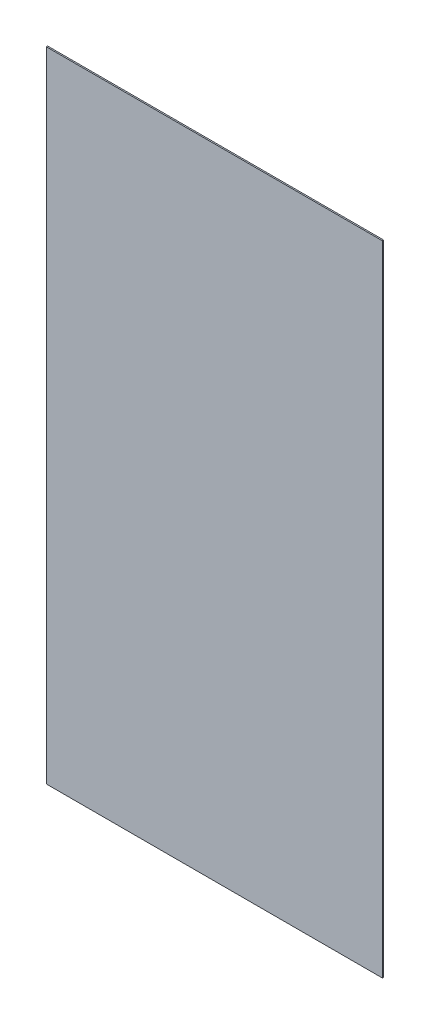
ISO-10303-21;
HEADER;
FILE_DESCRIPTION(('STEP AP214'),'2;1');
FILE_NAME('part.step','',(''),(''),'','','');
FILE_SCHEMA(('AUTOMOTIVE_DESIGN { 1 0 10303 214 1 1 1 1 }'));
ENDSEC;
DATA;
#1=APPLICATION_CONTEXT('core data for automotive mechanical design processes');
#2=APPLICATION_PROTOCOL_DEFINITION('international standard','automotive_design',2000,#1);
#3=PRODUCT_CONTEXT('',#1,'mechanical');
#4=PRODUCT('Part','Part','',(#3));
#5=PRODUCT_RELATED_PRODUCT_CATEGORY('part','',(#4));
#6=PRODUCT_DEFINITION_FORMATION('','',#4);
#7=PRODUCT_DEFINITION_CONTEXT('part definition',#1,'design');
#8=PRODUCT_DEFINITION('design','',#6,#7);
#9=PRODUCT_DEFINITION_SHAPE('','',#8);
#10=(LENGTH_UNIT() NAMED_UNIT(*) SI_UNIT(.MILLI.,.METRE.));
#11=(NAMED_UNIT(*) PLANE_ANGLE_UNIT() SI_UNIT($,.RADIAN.));
#12=(NAMED_UNIT(*) SI_UNIT($,.STERADIAN.) SOLID_ANGLE_UNIT());
#13=UNCERTAINTY_MEASURE_WITH_UNIT(LENGTH_MEASURE(1.E-05),#10,'distance_accuracy_value','');
#14=(GEOMETRIC_REPRESENTATION_CONTEXT(3) GLOBAL_UNCERTAINTY_ASSIGNED_CONTEXT((#13)) GLOBAL_UNIT_ASSIGNED_CONTEXT((#10,
#11,#12)) REPRESENTATION_CONTEXT('',''));
#15=CARTESIAN_POINT('',(0.,0.,0.));
#16=DIRECTION('',(0.,0.,1.));
#17=DIRECTION('',(1.,0.,0.));
#18=AXIS2_PLACEMENT_3D('',#15,#16,#17);
#19=CARTESIAN_POINT('',(0.,0.,0.));
#20=DIRECTION('',(0.,0.,1.));
#21=DIRECTION('',(1.,0.,0.));
#22=AXIS2_PLACEMENT_3D('',#19,#20,#21);
#23=PLANE('',#22);
#24=DIRECTION('',(1.,0.,0.));
#25=VECTOR('',#24,1.);
#26=CARTESIAN_POINT('',(12.7,24.13,0.));
#27=LINE('',#26,#25);
#28=CARTESIAN_POINT('',(12.7,24.13,0.));
#29=VERTEX_POINT('',#28);
#30=CARTESIAN_POINT('',(-12.7,24.13,0.));
#31=VERTEX_POINT('',#30);
#32=EDGE_CURVE('E77',#29,#31,#27,.F.);
#33=ORIENTED_EDGE('',*,*,#32,.F.);
#34=DIRECTION('',(0.,1.,0.));
#35=VECTOR('',#34,1.);
#36=CARTESIAN_POINT('',(12.7,-24.13,0.));
#37=LINE('',#36,#35);
#38=CARTESIAN_POINT('',(12.7,-24.13,0.));
#39=VERTEX_POINT('',#38);
#40=EDGE_CURVE('E53',#39,#29,#37,.T.);
#41=ORIENTED_EDGE('',*,*,#40,.F.);
#42=DIRECTION('',(1.,0.,0.));
#43=VECTOR('',#42,1.);
#44=CARTESIAN_POINT('',(-12.7,-24.13,0.));
#45=LINE('',#44,#43);
#46=CARTESIAN_POINT('',(-12.7,-24.13,0.));
#47=VERTEX_POINT('',#46);
#48=EDGE_CURVE('E55',#47,#39,#45,.T.);
#49=ORIENTED_EDGE('',*,*,#48,.F.);
#50=DIRECTION('',(0.,1.,0.));
#51=VECTOR('',#50,1.);
#52=CARTESIAN_POINT('',(-12.7,24.13,0.));
#53=LINE('',#52,#51);
#54=EDGE_CURVE('E18',#31,#47,#53,.F.);
#55=ORIENTED_EDGE('',*,*,#54,.F.);
#56=EDGE_LOOP('',(#33,#41,#49,#55));
#57=FACE_BOUND('',#56,.T.);
#58=ADVANCED_FACE('F15',(#57),#23,.F.);
#59=CARTESIAN_POINT('',(-12.7,24.13,0.));
#60=DIRECTION('',(-1.,0.,0.));
#61=DIRECTION('',(0.,0.,1.));
#62=AXIS2_PLACEMENT_3D('',#59,#60,#61);
#63=PLANE('',#62);
#64=DIRECTION('',(0.,1.,0.));
#65=VECTOR('',#64,1.);
#66=CARTESIAN_POINT('',(-12.7,0.,0.1));
#67=LINE('',#66,#65);
#68=CARTESIAN_POINT('',(-12.7,24.13,0.1));
#69=VERTEX_POINT('',#68);
#70=CARTESIAN_POINT('',(-12.7,-24.13,0.1));
#71=VERTEX_POINT('',#70);
#72=EDGE_CURVE('E81',#69,#71,#67,.F.);
#73=ORIENTED_EDGE('',*,*,#72,.F.);
#74=DIRECTION('',(0.,0.,1.));
#75=VECTOR('',#74,1.);
#76=CARTESIAN_POINT('',(-12.7,24.13,0.));
#77=LINE('',#76,#75);
#78=EDGE_CURVE('E66',#31,#69,#77,.T.);
#79=ORIENTED_EDGE('',*,*,#78,.F.);
#80=ORIENTED_EDGE('',*,*,#54,.T.);
#81=DIRECTION('',(0.,0.,-1.));
#82=VECTOR('',#81,1.);
#83=CARTESIAN_POINT('',(-12.7,-24.13,0.));
#84=LINE('',#83,#82);
#85=EDGE_CURVE('E61',#71,#47,#84,.T.);
#86=ORIENTED_EDGE('',*,*,#85,.F.);
#87=EDGE_LOOP('',(#73,#79,#80,#86));
#88=FACE_BOUND('',#87,.T.);
#89=ADVANCED_FACE('F63',(#88),#63,.T.);
#90=CARTESIAN_POINT('',(-12.7,-24.13,0.));
#91=DIRECTION('',(0.,-1.,0.));
#92=DIRECTION('',(0.,0.,-1.));
#93=AXIS2_PLACEMENT_3D('',#90,#91,#92);
#94=PLANE('',#93);
#95=DIRECTION('',(1.,0.,0.));
#96=VECTOR('',#95,1.);
#97=CARTESIAN_POINT('',(0.,-24.13,0.1));
#98=LINE('',#97,#96);
#99=CARTESIAN_POINT('',(12.7,-24.13,0.1));
#100=VERTEX_POINT('',#99);
#101=EDGE_CURVE('E70',#71,#100,#98,.T.);
#102=ORIENTED_EDGE('',*,*,#101,.F.);
#103=ORIENTED_EDGE('',*,*,#85,.T.);
#104=ORIENTED_EDGE('',*,*,#48,.T.);
#105=DIRECTION('',(0.,0.,-1.));
#106=VECTOR('',#105,1.);
#107=CARTESIAN_POINT('',(12.7,-24.13,0.));
#108=LINE('',#107,#106);
#109=EDGE_CURVE('E73',#100,#39,#108,.T.);
#110=ORIENTED_EDGE('',*,*,#109,.F.);
#111=EDGE_LOOP('',(#102,#103,#104,#110));
#112=FACE_BOUND('',#111,.T.);
#113=ADVANCED_FACE('F68',(#112),#94,.T.);
#114=CARTESIAN_POINT('',(12.7,-24.13,0.));
#115=DIRECTION('',(1.,0.,0.));
#116=DIRECTION('',(0.,0.,-1.));
#117=AXIS2_PLACEMENT_3D('',#114,#115,#116);
#118=PLANE('',#117);
#119=DIRECTION('',(0.,1.,0.));
#120=VECTOR('',#119,1.);
#121=CARTESIAN_POINT('',(12.7,0.,0.1));
#122=LINE('',#121,#120);
#123=CARTESIAN_POINT('',(12.7,24.13,0.1));
#124=VERTEX_POINT('',#123);
#125=EDGE_CURVE('E24',#100,#124,#122,.T.);
#126=ORIENTED_EDGE('',*,*,#125,.F.);
#127=ORIENTED_EDGE('',*,*,#109,.T.);
#128=ORIENTED_EDGE('',*,*,#40,.T.);
#129=DIRECTION('',(0.,0.,1.));
#130=VECTOR('',#129,1.);
#131=CARTESIAN_POINT('',(12.7,24.13,0.));
#132=LINE('',#131,#130);
#133=EDGE_CURVE('E33',#124,#29,#132,.F.);
#134=ORIENTED_EDGE('',*,*,#133,.F.);
#135=EDGE_LOOP('',(#126,#127,#128,#134));
#136=FACE_BOUND('',#135,.T.);
#137=ADVANCED_FACE('F87',(#136),#118,.T.);
#138=CARTESIAN_POINT('',(12.7,24.13,0.));
#139=DIRECTION('',(0.,1.,0.));
#140=DIRECTION('',(0.,0.,1.));
#141=AXIS2_PLACEMENT_3D('',#138,#139,#140);
#142=PLANE('',#141);
#143=DIRECTION('',(1.,0.,0.));
#144=VECTOR('',#143,1.);
#145=CARTESIAN_POINT('',(0.,24.13,0.1));
#146=LINE('',#145,#144);
#147=EDGE_CURVE('E10',#124,#69,#146,.F.);
#148=ORIENTED_EDGE('',*,*,#147,.F.);
#149=ORIENTED_EDGE('',*,*,#133,.T.);
#150=ORIENTED_EDGE('',*,*,#32,.T.);
#151=ORIENTED_EDGE('',*,*,#78,.T.);
#152=EDGE_LOOP('',(#148,#149,#150,#151));
#153=FACE_BOUND('',#152,.T.);
#154=ADVANCED_FACE('F89',(#153),#142,.T.);
#155=CARTESIAN_POINT('',(0.,0.,0.1));
#156=DIRECTION('',(0.,0.,1.));
#157=DIRECTION('',(1.,0.,0.));
#158=AXIS2_PLACEMENT_3D('',#155,#156,#157);
#159=PLANE('',#158);
#160=ORIENTED_EDGE('',*,*,#125,.T.);
#161=ORIENTED_EDGE('',*,*,#147,.T.);
#162=ORIENTED_EDGE('',*,*,#72,.T.);
#163=ORIENTED_EDGE('',*,*,#101,.T.);
#164=EDGE_LOOP('',(#160,#161,#162,#163));
#165=FACE_BOUND('',#164,.T.);
#166=ADVANCED_FACE('F86',(#165),#159,.T.);
#167=CLOSED_SHELL('',(#58,#89,#113,#137,#154,#166));
#168=MANIFOLD_SOLID_BREP('B1',#167);
#169=ADVANCED_BREP_SHAPE_REPRESENTATION('',(#18,#168),#14);
#170=SHAPE_DEFINITION_REPRESENTATION(#9,#169);
ENDSEC;
END-ISO-10303-21;
